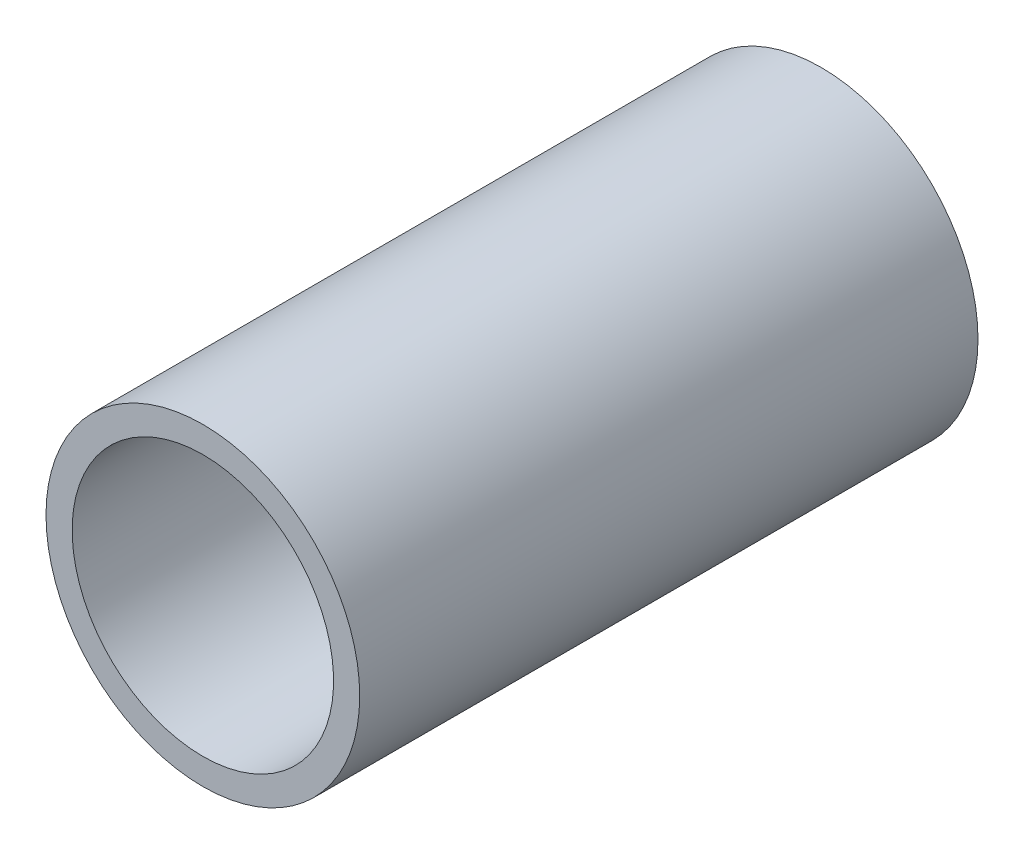
ISO-10303-21;
HEADER;
FILE_DESCRIPTION(('STEP AP214'),'2;1');
FILE_NAME('part.step','',(''),(''),'','','');
FILE_SCHEMA(('AUTOMOTIVE_DESIGN { 1 0 10303 214 1 1 1 1 }'));
ENDSEC;
DATA;
#1=APPLICATION_CONTEXT('core data for automotive mechanical design processes');
#2=APPLICATION_PROTOCOL_DEFINITION('international standard','automotive_design',2000,#1);
#3=PRODUCT_CONTEXT('',#1,'mechanical');
#4=PRODUCT('Part','Part','',(#3));
#5=PRODUCT_RELATED_PRODUCT_CATEGORY('part','',(#4));
#6=PRODUCT_DEFINITION_FORMATION('','',#4);
#7=PRODUCT_DEFINITION_CONTEXT('part definition',#1,'design');
#8=PRODUCT_DEFINITION('design','',#6,#7);
#9=PRODUCT_DEFINITION_SHAPE('','',#8);
#10=(LENGTH_UNIT() NAMED_UNIT(*) SI_UNIT(.MILLI.,.METRE.));
#11=(NAMED_UNIT(*) PLANE_ANGLE_UNIT() SI_UNIT($,.RADIAN.));
#12=(NAMED_UNIT(*) SI_UNIT($,.STERADIAN.) SOLID_ANGLE_UNIT());
#13=UNCERTAINTY_MEASURE_WITH_UNIT(LENGTH_MEASURE(1.E-05),#10,'distance_accuracy_value','');
#14=(GEOMETRIC_REPRESENTATION_CONTEXT(3) GLOBAL_UNCERTAINTY_ASSIGNED_CONTEXT((#13)) GLOBAL_UNIT_ASSIGNED_CONTEXT((#10,
#11,#12)) REPRESENTATION_CONTEXT('',''));
#15=CARTESIAN_POINT('',(0.,0.,0.));
#16=DIRECTION('',(0.,0.,1.));
#17=DIRECTION('',(1.,0.,0.));
#18=AXIS2_PLACEMENT_3D('',#15,#16,#17);
#19=CARTESIAN_POINT('',(0.,0.,40.6205627484771));
#20=DIRECTION('',(0.,0.,-1.));
#21=DIRECTION('',(-1.,0.,0.));
#22=AXIS2_PLACEMENT_3D('',#19,#20,#21);
#23=CYLINDRICAL_SURFACE('',#22,6.);
#24=CARTESIAN_POINT('',(0.,0.,0.));
#25=DIRECTION('',(0.,0.,1.));
#26=DIRECTION('',(1.,0.,0.));
#27=AXIS2_PLACEMENT_3D('',#24,#25,#26);
#28=CIRCLE('',#27,6.);
#29=CARTESIAN_POINT('',(6.,0.,0.));
#30=VERTEX_POINT('',#29);
#31=EDGE_CURVE('E40',#30,#30,#28,.T.);
#32=ORIENTED_EDGE('',*,*,#31,.T.);
#33=EDGE_LOOP('',(#32));
#34=FACE_BOUND('',#33,.T.);
#35=CARTESIAN_POINT('',(0.,0.,23.65));
#36=DIRECTION('',(0.,0.,1.));
#37=DIRECTION('',(0.,-1.,0.));
#38=AXIS2_PLACEMENT_3D('',#35,#36,#37);
#39=CIRCLE('',#38,6.);
#40=CARTESIAN_POINT('',(0.,-6.,23.65));
#41=VERTEX_POINT('',#40);
#42=EDGE_CURVE('E10',#41,#41,#39,.T.);
#43=ORIENTED_EDGE('',*,*,#42,.F.);
#44=EDGE_LOOP('',(#43));
#45=FACE_BOUND('',#44,.T.);
#46=ADVANCED_FACE('F33',(#34,#45),#23,.T.);
#47=CARTESIAN_POINT('',(0.,0.,0.));
#48=DIRECTION('',(0.,0.,1.));
#49=DIRECTION('',(1.,0.,0.));
#50=AXIS2_PLACEMENT_3D('',#47,#48,#49);
#51=PLANE('',#50);
#52=ORIENTED_EDGE('',*,*,#31,.F.);
#53=EDGE_LOOP('',(#52));
#54=FACE_BOUND('',#53,.T.);
#55=CARTESIAN_POINT('',(0.,0.,0.));
#56=DIRECTION('',(0.,0.,1.));
#57=DIRECTION('',(1.,0.,0.));
#58=AXIS2_PLACEMENT_3D('',#55,#56,#57);
#59=CIRCLE('',#58,5.);
#60=CARTESIAN_POINT('',(5.,0.,0.));
#61=VERTEX_POINT('',#60);
#62=EDGE_CURVE('E45',#61,#61,#59,.T.);
#63=ORIENTED_EDGE('',*,*,#62,.T.);
#64=EDGE_LOOP('',(#63));
#65=FACE_BOUND('',#64,.T.);
#66=ADVANCED_FACE('F61',(#54,#65),#51,.F.);
#67=CARTESIAN_POINT('',(0.,0.,40.6205627484771));
#68=DIRECTION('',(0.,0.,-1.));
#69=DIRECTION('',(-1.,0.,0.));
#70=AXIS2_PLACEMENT_3D('',#67,#68,#69);
#71=CYLINDRICAL_SURFACE('',#70,5.);
#72=ORIENTED_EDGE('',*,*,#62,.F.);
#73=EDGE_LOOP('',(#72));
#74=FACE_BOUND('',#73,.T.);
#75=CARTESIAN_POINT('',(0.,0.,23.65));
#76=DIRECTION('',(0.,0.,1.));
#77=DIRECTION('',(0.,-1.,0.));
#78=AXIS2_PLACEMENT_3D('',#75,#76,#77);
#79=CIRCLE('',#78,5.);
#80=CARTESIAN_POINT('',(0.,-5.,23.65));
#81=VERTEX_POINT('',#80);
#82=EDGE_CURVE('E36',#81,#81,#79,.T.);
#83=ORIENTED_EDGE('',*,*,#82,.T.);
#84=EDGE_LOOP('',(#83));
#85=FACE_BOUND('',#84,.T.);
#86=ADVANCED_FACE('F53',(#74,#85),#71,.F.);
#87=CARTESIAN_POINT('',(-3.71806493008705,-78.3736307260016,23.65));
#88=DIRECTION('',(0.,0.,1.));
#89=DIRECTION('',(-0.155319378796801,-0.987864307772164,0.));
#90=AXIS2_PLACEMENT_3D('',#87,#88,#89);
#91=PLANE('',#90);
#92=ORIENTED_EDGE('',*,*,#82,.F.);
#93=EDGE_LOOP('',(#92));
#94=FACE_BOUND('',#93,.T.);
#95=ORIENTED_EDGE('',*,*,#42,.T.);
#96=EDGE_LOOP('',(#95));
#97=FACE_BOUND('',#96,.T.);
#98=ADVANCED_FACE('F55',(#94,#97),#91,.T.);
#99=CLOSED_SHELL('',(#46,#66,#86,#98));
#100=MANIFOLD_SOLID_BREP('B2',#99);
#101=ADVANCED_BREP_SHAPE_REPRESENTATION('',(#18,#100),#14);
#102=SHAPE_DEFINITION_REPRESENTATION(#9,#101);
ENDSEC;
END-ISO-10303-21;
